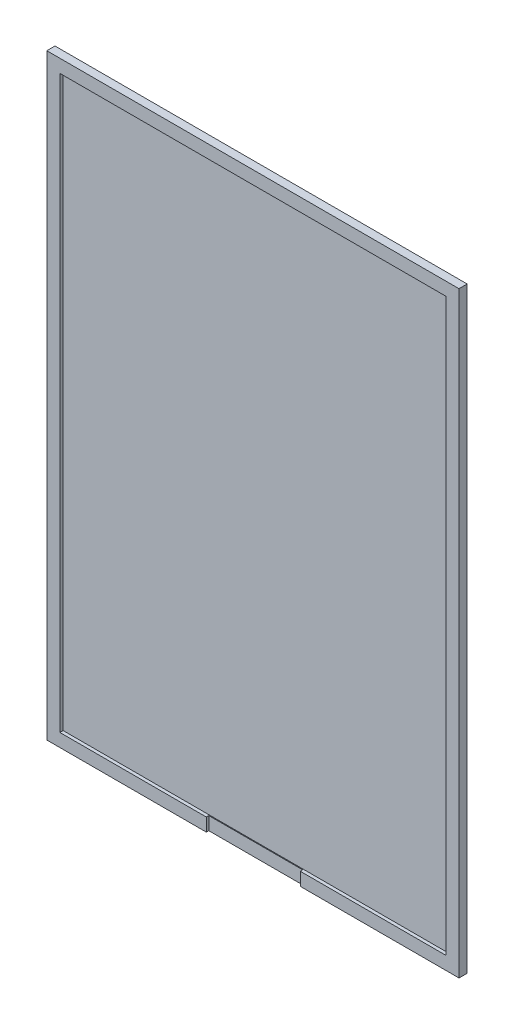
ISO-10303-21;
HEADER;
FILE_DESCRIPTION(('STEP AP214'),'2;1');
FILE_NAME('part.step','',(''),(''),'','','');
FILE_SCHEMA(('AUTOMOTIVE_DESIGN { 1 0 10303 214 1 1 1 1 }'));
ENDSEC;
DATA;
#1=APPLICATION_CONTEXT('core data for automotive mechanical design processes');
#2=APPLICATION_PROTOCOL_DEFINITION('international standard','automotive_design',2000,#1);
#3=PRODUCT_CONTEXT('',#1,'mechanical');
#4=PRODUCT('Part','Part','',(#3));
#5=PRODUCT_RELATED_PRODUCT_CATEGORY('part','',(#4));
#6=PRODUCT_DEFINITION_FORMATION('','',#4);
#7=PRODUCT_DEFINITION_CONTEXT('part definition',#1,'design');
#8=PRODUCT_DEFINITION('design','',#6,#7);
#9=PRODUCT_DEFINITION_SHAPE('','',#8);
#10=(LENGTH_UNIT() NAMED_UNIT(*) SI_UNIT(.MILLI.,.METRE.));
#11=(NAMED_UNIT(*) PLANE_ANGLE_UNIT() SI_UNIT($,.RADIAN.));
#12=(NAMED_UNIT(*) SI_UNIT($,.STERADIAN.) SOLID_ANGLE_UNIT());
#13=UNCERTAINTY_MEASURE_WITH_UNIT(LENGTH_MEASURE(1.E-05),#10,'distance_accuracy_value','');
#14=(GEOMETRIC_REPRESENTATION_CONTEXT(3) GLOBAL_UNCERTAINTY_ASSIGNED_CONTEXT((#13)) GLOBAL_UNIT_ASSIGNED_CONTEXT((#10,
#11,#12)) REPRESENTATION_CONTEXT('',''));
#15=CARTESIAN_POINT('',(0.,0.,0.));
#16=DIRECTION('',(0.,0.,1.));
#17=DIRECTION('',(1.,0.,0.));
#18=AXIS2_PLACEMENT_3D('',#15,#16,#17);
#19=CARTESIAN_POINT('',(-25.2,-36.5,1.));
#20=DIRECTION('',(1.,0.,0.));
#21=DIRECTION('',(0.,0.,-1.));
#22=AXIS2_PLACEMENT_3D('',#19,#20,#21);
#23=PLANE('',#22);
#24=DIRECTION('',(0.,-1.,0.));
#25=VECTOR('',#24,1.);
#26=CARTESIAN_POINT('',(-25.2,-36.5,0.));
#27=LINE('',#26,#25);
#28=CARTESIAN_POINT('',(-25.2,36.5,0.));
#29=VERTEX_POINT('',#28);
#30=CARTESIAN_POINT('',(-25.2,-36.5,0.));
#31=VERTEX_POINT('',#30);
#32=EDGE_CURVE('E208',#29,#31,#27,.T.);
#33=ORIENTED_EDGE('',*,*,#32,.T.);
#34=DIRECTION('',(0.,0.,-1.));
#35=VECTOR('',#34,1.);
#36=CARTESIAN_POINT('',(-25.2,-36.5,1.));
#37=LINE('',#36,#35);
#38=CARTESIAN_POINT('',(-25.2,-36.5,1.));
#39=VERTEX_POINT('',#38);
#40=EDGE_CURVE('E11',#39,#31,#37,.T.);
#41=ORIENTED_EDGE('',*,*,#40,.F.);
#42=DIRECTION('',(0.,-1.,0.));
#43=VECTOR('',#42,1.);
#44=CARTESIAN_POINT('',(-25.2,-36.5,1.));
#45=LINE('',#44,#43);
#46=CARTESIAN_POINT('',(-25.2,36.5,1.));
#47=VERTEX_POINT('',#46);
#48=EDGE_CURVE('E218',#47,#39,#45,.T.);
#49=ORIENTED_EDGE('',*,*,#48,.F.);
#50=DIRECTION('',(0.,0.,-1.));
#51=VECTOR('',#50,1.);
#52=CARTESIAN_POINT('',(-25.2,36.5,1.));
#53=LINE('',#52,#51);
#54=EDGE_CURVE('E233',#47,#29,#53,.T.);
#55=ORIENTED_EDGE('',*,*,#54,.T.);
#56=EDGE_LOOP('',(#33,#41,#49,#55));
#57=FACE_BOUND('',#56,.T.);
#58=ADVANCED_FACE('F41',(#57),#23,.F.);
#59=CARTESIAN_POINT('',(25.2,-36.5,1.));
#60=DIRECTION('',(0.,1.,0.));
#61=DIRECTION('',(0.,0.,1.));
#62=AXIS2_PLACEMENT_3D('',#59,#60,#61);
#63=PLANE('',#62);
#64=DIRECTION('',(1.,0.,0.));
#65=VECTOR('',#64,1.);
#66=CARTESIAN_POINT('',(5.8,-36.5,0.7));
#67=LINE('',#66,#65);
#68=CARTESIAN_POINT('',(-5.7,-36.5,0.7));
#69=VERTEX_POINT('',#68);
#70=CARTESIAN_POINT('',(5.8,-36.5,0.7));
#71=VERTEX_POINT('',#70);
#72=EDGE_CURVE('E144',#69,#71,#67,.T.);
#73=ORIENTED_EDGE('',*,*,#72,.F.);
#74=DIRECTION('',(0.,0.,1.));
#75=VECTOR('',#74,1.);
#76=CARTESIAN_POINT('',(-5.7,-36.5,0.7));
#77=LINE('',#76,#75);
#78=CARTESIAN_POINT('',(-5.7,-36.5,1.));
#79=VERTEX_POINT('',#78);
#80=EDGE_CURVE('E130',#69,#79,#77,.T.);
#81=ORIENTED_EDGE('',*,*,#80,.T.);
#82=DIRECTION('',(1.,0.,0.));
#83=VECTOR('',#82,1.);
#84=CARTESIAN_POINT('',(25.2,-36.5,1.));
#85=LINE('',#84,#83);
#86=EDGE_CURVE('E224',#39,#79,#85,.T.);
#87=ORIENTED_EDGE('',*,*,#86,.F.);
#88=ORIENTED_EDGE('',*,*,#40,.T.);
#89=DIRECTION('',(1.,0.,0.));
#90=VECTOR('',#89,1.);
#91=CARTESIAN_POINT('',(25.2,-36.5,0.));
#92=LINE('',#91,#90);
#93=CARTESIAN_POINT('',(25.2,-36.5,0.));
#94=VERTEX_POINT('',#93);
#95=EDGE_CURVE('E237',#31,#94,#92,.T.);
#96=ORIENTED_EDGE('',*,*,#95,.T.);
#97=DIRECTION('',(0.,0.,-1.));
#98=VECTOR('',#97,1.);
#99=CARTESIAN_POINT('',(25.2,-36.5,1.));
#100=LINE('',#99,#98);
#101=CARTESIAN_POINT('',(25.2,-36.5,1.));
#102=VERTEX_POINT('',#101);
#103=EDGE_CURVE('E49',#102,#94,#100,.T.);
#104=ORIENTED_EDGE('',*,*,#103,.F.);
#105=CARTESIAN_POINT('',(5.8,-36.5,1.));
#106=VERTEX_POINT('',#105);
#107=EDGE_CURVE('E222',#106,#102,#85,.T.);
#108=ORIENTED_EDGE('',*,*,#107,.F.);
#109=DIRECTION('',(0.,0.,1.));
#110=VECTOR('',#109,1.);
#111=CARTESIAN_POINT('',(5.8,-36.5,0.7));
#112=LINE('',#111,#110);
#113=EDGE_CURVE('E140',#71,#106,#112,.T.);
#114=ORIENTED_EDGE('',*,*,#113,.F.);
#115=EDGE_LOOP('',(#73,#81,#87,#88,#96,#104,#108,#114));
#116=FACE_BOUND('',#115,.T.);
#117=ADVANCED_FACE('F150',(#116),#63,.F.);
#118=CARTESIAN_POINT('',(25.2,-36.5,1.));
#119=DIRECTION('',(-1.,0.,0.));
#120=DIRECTION('',(0.,0.,1.));
#121=AXIS2_PLACEMENT_3D('',#118,#119,#120);
#122=PLANE('',#121);
#123=DIRECTION('',(0.,1.,0.));
#124=VECTOR('',#123,1.);
#125=CARTESIAN_POINT('',(25.2,-36.5,0.));
#126=LINE('',#125,#124);
#127=CARTESIAN_POINT('',(25.2,36.5,0.));
#128=VERTEX_POINT('',#127);
#129=EDGE_CURVE('E240',#94,#128,#126,.T.);
#130=ORIENTED_EDGE('',*,*,#129,.T.);
#131=DIRECTION('',(0.,0.,-1.));
#132=VECTOR('',#131,1.);
#133=CARTESIAN_POINT('',(25.2,36.5,1.));
#134=LINE('',#133,#132);
#135=CARTESIAN_POINT('',(25.2,36.5,1.));
#136=VERTEX_POINT('',#135);
#137=EDGE_CURVE('E248',#136,#128,#134,.T.);
#138=ORIENTED_EDGE('',*,*,#137,.F.);
#139=DIRECTION('',(0.,1.,0.));
#140=VECTOR('',#139,1.);
#141=CARTESIAN_POINT('',(25.2,-36.5,1.));
#142=LINE('',#141,#140);
#143=EDGE_CURVE('E227',#102,#136,#142,.T.);
#144=ORIENTED_EDGE('',*,*,#143,.F.);
#145=ORIENTED_EDGE('',*,*,#103,.T.);
#146=EDGE_LOOP('',(#130,#138,#144,#145));
#147=FACE_BOUND('',#146,.T.);
#148=ADVANCED_FACE('F257',(#147),#122,.F.);
#149=CARTESIAN_POINT('',(25.2,36.5,1.));
#150=DIRECTION('',(0.,-1.,0.));
#151=DIRECTION('',(0.,0.,-1.));
#152=AXIS2_PLACEMENT_3D('',#149,#150,#151);
#153=PLANE('',#152);
#154=DIRECTION('',(-1.,0.,0.));
#155=VECTOR('',#154,1.);
#156=CARTESIAN_POINT('',(25.2,36.5,0.));
#157=LINE('',#156,#155);
#158=EDGE_CURVE('E223',#128,#29,#157,.T.);
#159=ORIENTED_EDGE('',*,*,#158,.T.);
#160=ORIENTED_EDGE('',*,*,#54,.F.);
#161=DIRECTION('',(-1.,0.,0.));
#162=VECTOR('',#161,1.);
#163=CARTESIAN_POINT('',(25.2,36.5,1.));
#164=LINE('',#163,#162);
#165=EDGE_CURVE('E230',#136,#47,#164,.T.);
#166=ORIENTED_EDGE('',*,*,#165,.F.);
#167=ORIENTED_EDGE('',*,*,#137,.T.);
#168=EDGE_LOOP('',(#159,#160,#166,#167));
#169=FACE_BOUND('',#168,.T.);
#170=ADVANCED_FACE('F265',(#169),#153,.F.);
#171=CARTESIAN_POINT('',(0.,0.,1.));
#172=DIRECTION('',(0.,0.,1.));
#173=DIRECTION('',(1.,0.,0.));
#174=AXIS2_PLACEMENT_3D('',#171,#172,#173);
#175=PLANE('',#174);
#176=DIRECTION('',(0.,-1.,0.));
#177=VECTOR('',#176,1.);
#178=CARTESIAN_POINT('',(-5.7,0.,1.));
#179=LINE('',#178,#177);
#180=CARTESIAN_POINT('',(-5.7,-34.9,1.));
#181=VERTEX_POINT('',#180);
#182=EDGE_CURVE('E135',#181,#79,#179,.T.);
#183=ORIENTED_EDGE('',*,*,#182,.F.);
#184=DIRECTION('',(1.,0.,0.));
#185=VECTOR('',#184,1.);
#186=CARTESIAN_POINT('',(23.6,-34.9,1.));
#187=LINE('',#186,#185);
#188=CARTESIAN_POINT('',(-23.6,-34.9,1.));
#189=VERTEX_POINT('',#188);
#190=EDGE_CURVE('E194',#189,#181,#187,.T.);
#191=ORIENTED_EDGE('',*,*,#190,.F.);
#192=DIRECTION('',(0.,-1.,0.));
#193=VECTOR('',#192,1.);
#194=CARTESIAN_POINT('',(-23.6,-34.9,1.));
#195=LINE('',#194,#193);
#196=CARTESIAN_POINT('',(-23.6,34.9,1.));
#197=VERTEX_POINT('',#196);
#198=EDGE_CURVE('E64',#197,#189,#195,.T.);
#199=ORIENTED_EDGE('',*,*,#198,.F.);
#200=DIRECTION('',(-1.,0.,0.));
#201=VECTOR('',#200,1.);
#202=CARTESIAN_POINT('',(23.6,34.9,1.));
#203=LINE('',#202,#201);
#204=CARTESIAN_POINT('',(23.6,34.9,1.));
#205=VERTEX_POINT('',#204);
#206=EDGE_CURVE('E178',#205,#197,#203,.T.);
#207=ORIENTED_EDGE('',*,*,#206,.F.);
#208=DIRECTION('',(0.,1.,0.));
#209=VECTOR('',#208,1.);
#210=CARTESIAN_POINT('',(23.6,-34.9,1.));
#211=LINE('',#210,#209);
#212=CARTESIAN_POINT('',(23.6,-34.9,1.));
#213=VERTEX_POINT('',#212);
#214=EDGE_CURVE('E198',#213,#205,#211,.T.);
#215=ORIENTED_EDGE('',*,*,#214,.F.);
#216=CARTESIAN_POINT('',(5.8,-34.9,1.));
#217=VERTEX_POINT('',#216);
#218=EDGE_CURVE('E193',#217,#213,#187,.T.);
#219=ORIENTED_EDGE('',*,*,#218,.F.);
#220=DIRECTION('',(0.,1.,0.));
#221=VECTOR('',#220,1.);
#222=CARTESIAN_POINT('',(5.8,0.,1.));
#223=LINE('',#222,#221);
#224=EDGE_CURVE('E162',#106,#217,#223,.T.);
#225=ORIENTED_EDGE('',*,*,#224,.F.);
#226=ORIENTED_EDGE('',*,*,#107,.T.);
#227=ORIENTED_EDGE('',*,*,#143,.T.);
#228=ORIENTED_EDGE('',*,*,#165,.T.);
#229=ORIENTED_EDGE('',*,*,#48,.T.);
#230=ORIENTED_EDGE('',*,*,#86,.T.);
#231=EDGE_LOOP('',(#183,#191,#199,#207,#215,#219,#225,#226,#227,#228,#229,#230));
#232=FACE_BOUND('',#231,.T.);
#233=ADVANCED_FACE('F271',(#232),#175,.T.);
#234=CARTESIAN_POINT('',(0.,0.,0.));
#235=DIRECTION('',(0.,0.,1.));
#236=DIRECTION('',(1.,0.,0.));
#237=AXIS2_PLACEMENT_3D('',#234,#235,#236);
#238=PLANE('',#237);
#239=ORIENTED_EDGE('',*,*,#32,.F.);
#240=ORIENTED_EDGE('',*,*,#158,.F.);
#241=ORIENTED_EDGE('',*,*,#129,.F.);
#242=ORIENTED_EDGE('',*,*,#95,.F.);
#243=EDGE_LOOP('',(#239,#240,#241,#242));
#244=FACE_BOUND('',#243,.T.);
#245=ADVANCED_FACE('F262',(#244),#238,.F.);
#246=CARTESIAN_POINT('',(-23.6,-34.9,0.6));
#247=DIRECTION('',(-1.,0.,0.));
#248=DIRECTION('',(0.,0.,1.));
#249=AXIS2_PLACEMENT_3D('',#246,#247,#248);
#250=PLANE('',#249);
#251=ORIENTED_EDGE('',*,*,#198,.T.);
#252=DIRECTION('',(0.,0.,1.));
#253=VECTOR('',#252,1.);
#254=CARTESIAN_POINT('',(-23.6,-34.9,0.6));
#255=LINE('',#254,#253);
#256=CARTESIAN_POINT('',(-23.6,-34.9,0.6));
#257=VERTEX_POINT('',#256);
#258=EDGE_CURVE('E190',#257,#189,#255,.T.);
#259=ORIENTED_EDGE('',*,*,#258,.F.);
#260=DIRECTION('',(0.,-1.,0.));
#261=VECTOR('',#260,1.);
#262=CARTESIAN_POINT('',(-23.6,-34.9,0.6));
#263=LINE('',#262,#261);
#264=CARTESIAN_POINT('',(-23.6,34.9,0.6));
#265=VERTEX_POINT('',#264);
#266=EDGE_CURVE('E173',#265,#257,#263,.T.);
#267=ORIENTED_EDGE('',*,*,#266,.F.);
#268=DIRECTION('',(0.,0.,1.));
#269=VECTOR('',#268,1.);
#270=CARTESIAN_POINT('',(-23.6,34.9,0.6));
#271=LINE('',#270,#269);
#272=EDGE_CURVE('E205',#265,#197,#271,.T.);
#273=ORIENTED_EDGE('',*,*,#272,.T.);
#274=EDGE_LOOP('',(#251,#259,#267,#273));
#275=FACE_BOUND('',#274,.T.);
#276=ADVANCED_FACE('F291',(#275),#250,.F.);
#277=CARTESIAN_POINT('',(23.6,34.9,0.6));
#278=DIRECTION('',(0.,1.,0.));
#279=DIRECTION('',(0.,0.,1.));
#280=AXIS2_PLACEMENT_3D('',#277,#278,#279);
#281=PLANE('',#280);
#282=ORIENTED_EDGE('',*,*,#206,.T.);
#283=ORIENTED_EDGE('',*,*,#272,.F.);
#284=DIRECTION('',(-1.,0.,0.));
#285=VECTOR('',#284,1.);
#286=CARTESIAN_POINT('',(23.6,34.9,0.6));
#287=LINE('',#286,#285);
#288=CARTESIAN_POINT('',(23.6,34.9,0.6));
#289=VERTEX_POINT('',#288);
#290=EDGE_CURVE('E186',#289,#265,#287,.T.);
#291=ORIENTED_EDGE('',*,*,#290,.F.);
#292=DIRECTION('',(0.,0.,1.));
#293=VECTOR('',#292,1.);
#294=CARTESIAN_POINT('',(23.6,34.9,0.6));
#295=LINE('',#294,#293);
#296=EDGE_CURVE('E209',#289,#205,#295,.T.);
#297=ORIENTED_EDGE('',*,*,#296,.T.);
#298=EDGE_LOOP('',(#282,#283,#291,#297));
#299=FACE_BOUND('',#298,.T.);
#300=ADVANCED_FACE('F286',(#299),#281,.F.);
#301=CARTESIAN_POINT('',(23.6,-34.9,0.6));
#302=DIRECTION('',(1.,0.,0.));
#303=DIRECTION('',(0.,0.,-1.));
#304=AXIS2_PLACEMENT_3D('',#301,#302,#303);
#305=PLANE('',#304);
#306=ORIENTED_EDGE('',*,*,#214,.T.);
#307=ORIENTED_EDGE('',*,*,#296,.F.);
#308=DIRECTION('',(0.,1.,0.));
#309=VECTOR('',#308,1.);
#310=CARTESIAN_POINT('',(23.6,-34.9,0.6));
#311=LINE('',#310,#309);
#312=CARTESIAN_POINT('',(23.6,-34.9,0.6));
#313=VERTEX_POINT('',#312);
#314=EDGE_CURVE('E182',#313,#289,#311,.T.);
#315=ORIENTED_EDGE('',*,*,#314,.F.);
#316=DIRECTION('',(0.,0.,1.));
#317=VECTOR('',#316,1.);
#318=CARTESIAN_POINT('',(23.6,-34.9,0.6));
#319=LINE('',#318,#317);
#320=EDGE_CURVE('E212',#313,#213,#319,.T.);
#321=ORIENTED_EDGE('',*,*,#320,.T.);
#322=EDGE_LOOP('',(#306,#307,#315,#321));
#323=FACE_BOUND('',#322,.T.);
#324=ADVANCED_FACE('F282',(#323),#305,.F.);
#325=CARTESIAN_POINT('',(23.6,-34.9,0.6));
#326=DIRECTION('',(0.,-1.,0.));
#327=DIRECTION('',(0.,0.,-1.));
#328=AXIS2_PLACEMENT_3D('',#325,#326,#327);
#329=PLANE('',#328);
#330=ORIENTED_EDGE('',*,*,#190,.T.);
#331=DIRECTION('',(0.,0.,1.));
#332=VECTOR('',#331,1.);
#333=CARTESIAN_POINT('',(-5.7,-34.9,0.7));
#334=LINE('',#333,#332);
#335=CARTESIAN_POINT('',(-5.7,-34.9,0.7));
#336=VERTEX_POINT('',#335);
#337=EDGE_CURVE('E159',#336,#181,#334,.T.);
#338=ORIENTED_EDGE('',*,*,#337,.F.);
#339=DIRECTION('',(-1.,0.,0.));
#340=VECTOR('',#339,1.);
#341=CARTESIAN_POINT('',(-5.7,-34.9,0.7));
#342=LINE('',#341,#340);
#343=CARTESIAN_POINT('',(5.8,-34.9,0.7));
#344=VERTEX_POINT('',#343);
#345=EDGE_CURVE('E141',#344,#336,#342,.T.);
#346=ORIENTED_EDGE('',*,*,#345,.F.);
#347=DIRECTION('',(0.,0.,1.));
#348=VECTOR('',#347,1.);
#349=CARTESIAN_POINT('',(5.8,-34.9,0.7));
#350=LINE('',#349,#348);
#351=EDGE_CURVE('E163',#344,#217,#350,.T.);
#352=ORIENTED_EDGE('',*,*,#351,.T.);
#353=ORIENTED_EDGE('',*,*,#218,.T.);
#354=ORIENTED_EDGE('',*,*,#320,.F.);
#355=DIRECTION('',(1.,0.,0.));
#356=VECTOR('',#355,1.);
#357=CARTESIAN_POINT('',(23.6,-34.9,0.6));
#358=LINE('',#357,#356);
#359=EDGE_CURVE('E177',#257,#313,#358,.T.);
#360=ORIENTED_EDGE('',*,*,#359,.F.);
#361=ORIENTED_EDGE('',*,*,#258,.T.);
#362=EDGE_LOOP('',(#330,#338,#346,#352,#353,#354,#360,#361));
#363=FACE_BOUND('',#362,.T.);
#364=ADVANCED_FACE('F277',(#363),#329,.F.);
#365=CARTESIAN_POINT('',(0.,0.,0.6));
#366=DIRECTION('',(0.,0.,1.));
#367=DIRECTION('',(1.,0.,0.));
#368=AXIS2_PLACEMENT_3D('',#365,#366,#367);
#369=PLANE('',#368);
#370=ORIENTED_EDGE('',*,*,#266,.T.);
#371=ORIENTED_EDGE('',*,*,#359,.T.);
#372=ORIENTED_EDGE('',*,*,#314,.T.);
#373=ORIENTED_EDGE('',*,*,#290,.T.);
#374=EDGE_LOOP('',(#370,#371,#372,#373));
#375=FACE_BOUND('',#374,.T.);
#376=ADVANCED_FACE('F290',(#375),#369,.T.);
#377=CARTESIAN_POINT('',(-5.7,-36.5,0.7));
#378=DIRECTION('',(-1.,0.,0.));
#379=DIRECTION('',(0.,0.,1.));
#380=AXIS2_PLACEMENT_3D('',#377,#378,#379);
#381=PLANE('',#380);
#382=ORIENTED_EDGE('',*,*,#182,.T.);
#383=ORIENTED_EDGE('',*,*,#80,.F.);
#384=DIRECTION('',(0.,-1.,0.));
#385=VECTOR('',#384,1.);
#386=CARTESIAN_POINT('',(-5.7,-36.5,0.7));
#387=LINE('',#386,#385);
#388=EDGE_CURVE('E133',#336,#69,#387,.T.);
#389=ORIENTED_EDGE('',*,*,#388,.F.);
#390=ORIENTED_EDGE('',*,*,#337,.T.);
#391=EDGE_LOOP('',(#382,#383,#389,#390));
#392=FACE_BOUND('',#391,.T.);
#393=ADVANCED_FACE('F132',(#392),#381,.F.);
#394=CARTESIAN_POINT('',(5.8,-34.9,0.7));
#395=DIRECTION('',(1.,0.,0.));
#396=DIRECTION('',(0.,0.,-1.));
#397=AXIS2_PLACEMENT_3D('',#394,#395,#396);
#398=PLANE('',#397);
#399=ORIENTED_EDGE('',*,*,#224,.T.);
#400=ORIENTED_EDGE('',*,*,#351,.F.);
#401=DIRECTION('',(0.,1.,0.));
#402=VECTOR('',#401,1.);
#403=CARTESIAN_POINT('',(5.8,-34.9,0.7));
#404=LINE('',#403,#402);
#405=EDGE_CURVE('E56',#71,#344,#404,.T.);
#406=ORIENTED_EDGE('',*,*,#405,.F.);
#407=ORIENTED_EDGE('',*,*,#113,.T.);
#408=EDGE_LOOP('',(#399,#400,#406,#407));
#409=FACE_BOUND('',#408,.T.);
#410=ADVANCED_FACE('F387',(#409),#398,.F.);
#411=CARTESIAN_POINT('',(0.,0.,0.7));
#412=DIRECTION('',(0.,0.,-1.));
#413=DIRECTION('',(-1.,0.,0.));
#414=AXIS2_PLACEMENT_3D('',#411,#412,#413);
#415=PLANE('',#414);
#416=ORIENTED_EDGE('',*,*,#388,.T.);
#417=ORIENTED_EDGE('',*,*,#72,.T.);
#418=ORIENTED_EDGE('',*,*,#405,.T.);
#419=ORIENTED_EDGE('',*,*,#345,.T.);
#420=EDGE_LOOP('',(#416,#417,#418,#419));
#421=FACE_BOUND('',#420,.T.);
#422=ADVANCED_FACE('F143',(#421),#415,.F.);
#423=CLOSED_SHELL('',(#58,#117,#148,#170,#233,#245,#276,#300,#324,#364,#376,#393,#410,#422));
#424=MANIFOLD_SOLID_BREP('B2',#423);
#425=ADVANCED_BREP_SHAPE_REPRESENTATION('',(#18,#424),#14);
#426=SHAPE_DEFINITION_REPRESENTATION(#9,#425);
ENDSEC;
END-ISO-10303-21;
